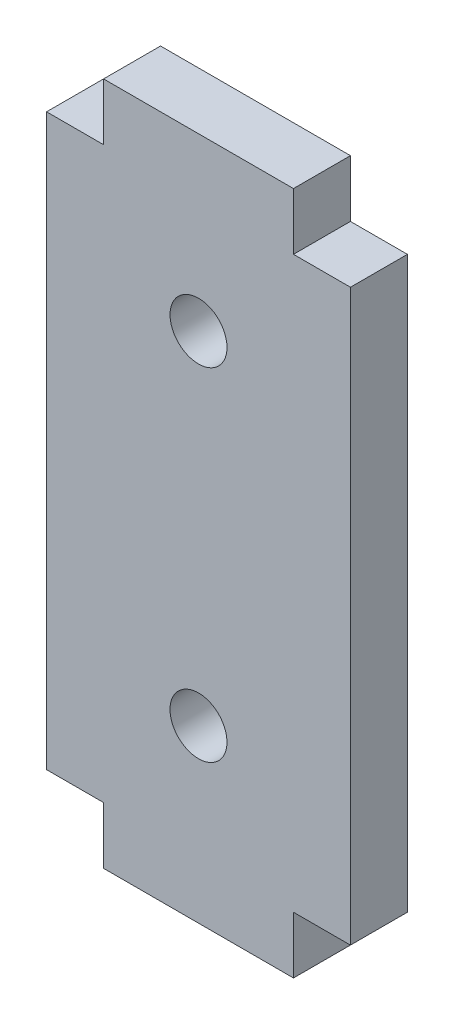
ISO-10303-21;
HEADER;
FILE_DESCRIPTION(('STEP AP214'),'2;1');
FILE_NAME('part.step','',(''),(''),'','','');
FILE_SCHEMA(('AUTOMOTIVE_DESIGN { 1 0 10303 214 1 1 1 1 }'));
ENDSEC;
DATA;
#1=APPLICATION_CONTEXT('core data for automotive mechanical design processes');
#2=APPLICATION_PROTOCOL_DEFINITION('international standard','automotive_design',2000,#1);
#3=PRODUCT_CONTEXT('',#1,'mechanical');
#4=PRODUCT('Part','Part','',(#3));
#5=PRODUCT_RELATED_PRODUCT_CATEGORY('part','',(#4));
#6=PRODUCT_DEFINITION_FORMATION('','',#4);
#7=PRODUCT_DEFINITION_CONTEXT('part definition',#1,'design');
#8=PRODUCT_DEFINITION('design','',#6,#7);
#9=PRODUCT_DEFINITION_SHAPE('','',#8);
#10=(LENGTH_UNIT() NAMED_UNIT(*) SI_UNIT(.MILLI.,.METRE.));
#11=(NAMED_UNIT(*) PLANE_ANGLE_UNIT() SI_UNIT($,.RADIAN.));
#12=(NAMED_UNIT(*) SI_UNIT($,.STERADIAN.) SOLID_ANGLE_UNIT());
#13=UNCERTAINTY_MEASURE_WITH_UNIT(LENGTH_MEASURE(1.E-05),#10,'distance_accuracy_value','');
#14=(GEOMETRIC_REPRESENTATION_CONTEXT(3) GLOBAL_UNCERTAINTY_ASSIGNED_CONTEXT((#13)) GLOBAL_UNIT_ASSIGNED_CONTEXT((#10,
#11,#12)) REPRESENTATION_CONTEXT('',''));
#15=CARTESIAN_POINT('',(0.,0.,0.));
#16=DIRECTION('',(0.,0.,1.));
#17=DIRECTION('',(1.,0.,0.));
#18=AXIS2_PLACEMENT_3D('',#15,#16,#17);
#19=CARTESIAN_POINT('',(0.,0.,3.));
#20=DIRECTION('',(0.,0.,1.));
#21=DIRECTION('',(1.,0.,0.));
#22=AXIS2_PLACEMENT_3D('',#19,#20,#21);
#23=PLANE('',#22);
#24=CARTESIAN_POINT('',(0.,9.,3.));
#25=DIRECTION('',(0.,0.,1.));
#26=DIRECTION('',(1.,0.,0.));
#27=AXIS2_PLACEMENT_3D('',#24,#25,#26);
#28=CIRCLE('',#27,1.5);
#29=CARTESIAN_POINT('',(1.5,9.,3.));
#30=VERTEX_POINT('',#29);
#31=EDGE_CURVE('E158',#30,#30,#28,.T.);
#32=ORIENTED_EDGE('',*,*,#31,.F.);
#33=EDGE_LOOP('',(#32));
#34=FACE_BOUND('',#33,.T.);
#35=DIRECTION('',(0.,-1.,0.));
#36=VECTOR('',#35,1.);
#37=CARTESIAN_POINT('',(-5.,18.,3.));
#38=LINE('',#37,#36);
#39=CARTESIAN_POINT('',(-5.,18.,3.));
#40=VERTEX_POINT('',#39);
#41=CARTESIAN_POINT('',(-5.,15.,3.));
#42=VERTEX_POINT('',#41);
#43=EDGE_CURVE('E177',#40,#42,#38,.T.);
#44=ORIENTED_EDGE('',*,*,#43,.T.);
#45=DIRECTION('',(-1.,0.,0.));
#46=VECTOR('',#45,1.);
#47=CARTESIAN_POINT('',(-8.,15.,3.));
#48=LINE('',#47,#46);
#49=CARTESIAN_POINT('',(-8.,15.,3.));
#50=VERTEX_POINT('',#49);
#51=EDGE_CURVE('E105',#42,#50,#48,.T.);
#52=ORIENTED_EDGE('',*,*,#51,.T.);
#53=DIRECTION('',(0.,-1.,0.));
#54=VECTOR('',#53,1.);
#55=CARTESIAN_POINT('',(-8.,15.,3.));
#56=LINE('',#55,#54);
#57=CARTESIAN_POINT('',(-8.,-15.,3.));
#58=VERTEX_POINT('',#57);
#59=EDGE_CURVE('E204',#50,#58,#56,.T.);
#60=ORIENTED_EDGE('',*,*,#59,.T.);
#61=DIRECTION('',(1.,0.,0.));
#62=VECTOR('',#61,1.);
#63=CARTESIAN_POINT('',(-8.,-15.,3.));
#64=LINE('',#63,#62);
#65=CARTESIAN_POINT('',(-5.,-15.,3.));
#66=VERTEX_POINT('',#65);
#67=EDGE_CURVE('E223',#58,#66,#64,.T.);
#68=ORIENTED_EDGE('',*,*,#67,.T.);
#69=DIRECTION('',(0.,-1.,0.));
#70=VECTOR('',#69,1.);
#71=CARTESIAN_POINT('',(-5.,-18.,3.));
#72=LINE('',#71,#70);
#73=CARTESIAN_POINT('',(-5.,-18.,3.));
#74=VERTEX_POINT('',#73);
#75=EDGE_CURVE('E220',#66,#74,#72,.T.);
#76=ORIENTED_EDGE('',*,*,#75,.T.);
#77=DIRECTION('',(1.,0.,0.));
#78=VECTOR('',#77,1.);
#79=CARTESIAN_POINT('',(-5.,-18.,3.));
#80=LINE('',#79,#78);
#81=CARTESIAN_POINT('',(4.99999999999999,-18.,3.));
#82=VERTEX_POINT('',#81);
#83=EDGE_CURVE('E222',#74,#82,#80,.T.);
#84=ORIENTED_EDGE('',*,*,#83,.T.);
#85=DIRECTION('',(0.,1.,0.));
#86=VECTOR('',#85,1.);
#87=CARTESIAN_POINT('',(4.99999999999999,-18.,3.));
#88=LINE('',#87,#86);
#89=CARTESIAN_POINT('',(4.99999999999999,-15.,3.));
#90=VERTEX_POINT('',#89);
#91=EDGE_CURVE('E225',#82,#90,#88,.T.);
#92=ORIENTED_EDGE('',*,*,#91,.T.);
#93=DIRECTION('',(1.,0.,0.));
#94=VECTOR('',#93,1.);
#95=CARTESIAN_POINT('',(4.99999999999999,-15.,3.));
#96=LINE('',#95,#94);
#97=CARTESIAN_POINT('',(8.,-15.,3.));
#98=VERTEX_POINT('',#97);
#99=EDGE_CURVE('E231',#90,#98,#96,.T.);
#100=ORIENTED_EDGE('',*,*,#99,.T.);
#101=DIRECTION('',(0.,1.,0.));
#102=VECTOR('',#101,1.);
#103=CARTESIAN_POINT('',(8.,15.,3.));
#104=LINE('',#103,#102);
#105=CARTESIAN_POINT('',(8.,15.,3.));
#106=VERTEX_POINT('',#105);
#107=EDGE_CURVE('E136',#98,#106,#104,.T.);
#108=ORIENTED_EDGE('',*,*,#107,.T.);
#109=DIRECTION('',(-1.,0.,0.));
#110=VECTOR('',#109,1.);
#111=CARTESIAN_POINT('',(5.,15.,3.));
#112=LINE('',#111,#110);
#113=CARTESIAN_POINT('',(5.,15.,3.));
#114=VERTEX_POINT('',#113);
#115=EDGE_CURVE('E130',#106,#114,#112,.T.);
#116=ORIENTED_EDGE('',*,*,#115,.T.);
#117=DIRECTION('',(0.,1.,0.));
#118=VECTOR('',#117,1.);
#119=CARTESIAN_POINT('',(5.,18.,3.));
#120=LINE('',#119,#118);
#121=CARTESIAN_POINT('',(5.,18.,3.));
#122=VERTEX_POINT('',#121);
#123=EDGE_CURVE('E134',#114,#122,#120,.T.);
#124=ORIENTED_EDGE('',*,*,#123,.T.);
#125=DIRECTION('',(-1.,0.,0.));
#126=VECTOR('',#125,1.);
#127=CARTESIAN_POINT('',(-5.,18.,3.));
#128=LINE('',#127,#126);
#129=EDGE_CURVE('E50',#122,#40,#128,.T.);
#130=ORIENTED_EDGE('',*,*,#129,.T.);
#131=EDGE_LOOP('',(#44,#52,#60,#68,#76,#84,#92,#100,#108,#116,#124,#130));
#132=FACE_BOUND('',#131,.T.);
#133=CARTESIAN_POINT('',(0.,-9.,3.));
#134=DIRECTION('',(0.,0.,1.));
#135=DIRECTION('',(-1.,0.,0.));
#136=AXIS2_PLACEMENT_3D('',#133,#134,#135);
#137=CIRCLE('',#136,1.5);
#138=CARTESIAN_POINT('',(-1.50000000000001,-9.,3.));
#139=VERTEX_POINT('',#138);
#140=EDGE_CURVE('E273',#139,#139,#137,.T.);
#141=ORIENTED_EDGE('',*,*,#140,.F.);
#142=EDGE_LOOP('',(#141));
#143=FACE_BOUND('',#142,.T.);
#144=ADVANCED_FACE('F33',(#34,#132,#143),#23,.T.);
#145=CARTESIAN_POINT('',(0.,0.,0.));
#146=DIRECTION('',(0.,0.,1.));
#147=DIRECTION('',(1.,0.,0.));
#148=AXIS2_PLACEMENT_3D('',#145,#146,#147);
#149=PLANE('',#148);
#150=DIRECTION('',(0.,-1.,0.));
#151=VECTOR('',#150,1.);
#152=CARTESIAN_POINT('',(-5.,18.,0.));
#153=LINE('',#152,#151);
#154=CARTESIAN_POINT('',(-5.,18.,0.));
#155=VERTEX_POINT('',#154);
#156=CARTESIAN_POINT('',(-5.,15.,0.));
#157=VERTEX_POINT('',#156);
#158=EDGE_CURVE('E154',#155,#157,#153,.T.);
#159=ORIENTED_EDGE('',*,*,#158,.F.);
#160=DIRECTION('',(-1.,0.,0.));
#161=VECTOR('',#160,1.);
#162=CARTESIAN_POINT('',(-5.,18.,0.));
#163=LINE('',#162,#161);
#164=CARTESIAN_POINT('',(5.,18.,0.));
#165=VERTEX_POINT('',#164);
#166=EDGE_CURVE('E97',#165,#155,#163,.T.);
#167=ORIENTED_EDGE('',*,*,#166,.F.);
#168=DIRECTION('',(0.,1.,0.));
#169=VECTOR('',#168,1.);
#170=CARTESIAN_POINT('',(5.,18.,0.));
#171=LINE('',#170,#169);
#172=CARTESIAN_POINT('',(5.,15.,0.));
#173=VERTEX_POINT('',#172);
#174=EDGE_CURVE('E91',#173,#165,#171,.T.);
#175=ORIENTED_EDGE('',*,*,#174,.F.);
#176=DIRECTION('',(-1.,0.,0.));
#177=VECTOR('',#176,1.);
#178=CARTESIAN_POINT('',(5.,15.,0.));
#179=LINE('',#178,#177);
#180=CARTESIAN_POINT('',(8.,15.,0.));
#181=VERTEX_POINT('',#180);
#182=EDGE_CURVE('E144',#181,#173,#179,.T.);
#183=ORIENTED_EDGE('',*,*,#182,.F.);
#184=DIRECTION('',(0.,1.,0.));
#185=VECTOR('',#184,1.);
#186=CARTESIAN_POINT('',(8.,15.,0.));
#187=LINE('',#186,#185);
#188=CARTESIAN_POINT('',(8.,-15.,0.));
#189=VERTEX_POINT('',#188);
#190=EDGE_CURVE('E172',#189,#181,#187,.T.);
#191=ORIENTED_EDGE('',*,*,#190,.F.);
#192=DIRECTION('',(1.,0.,0.));
#193=VECTOR('',#192,1.);
#194=CARTESIAN_POINT('',(4.99999999999999,-15.,0.));
#195=LINE('',#194,#193);
#196=CARTESIAN_POINT('',(4.99999999999999,-15.,0.));
#197=VERTEX_POINT('',#196);
#198=EDGE_CURVE('E170',#197,#189,#195,.T.);
#199=ORIENTED_EDGE('',*,*,#198,.F.);
#200=DIRECTION('',(0.,1.,0.));
#201=VECTOR('',#200,1.);
#202=CARTESIAN_POINT('',(4.99999999999999,-18.,0.));
#203=LINE('',#202,#201);
#204=CARTESIAN_POINT('',(4.99999999999999,-18.,0.));
#205=VERTEX_POINT('',#204);
#206=EDGE_CURVE('E168',#205,#197,#203,.T.);
#207=ORIENTED_EDGE('',*,*,#206,.F.);
#208=DIRECTION('',(1.,0.,0.));
#209=VECTOR('',#208,1.);
#210=CARTESIAN_POINT('',(-5.,-18.,0.));
#211=LINE('',#210,#209);
#212=CARTESIAN_POINT('',(-5.,-18.,0.));
#213=VERTEX_POINT('',#212);
#214=EDGE_CURVE('E166',#213,#205,#211,.T.);
#215=ORIENTED_EDGE('',*,*,#214,.F.);
#216=DIRECTION('',(0.,-1.,0.));
#217=VECTOR('',#216,1.);
#218=CARTESIAN_POINT('',(-5.,-18.,0.));
#219=LINE('',#218,#217);
#220=CARTESIAN_POINT('',(-5.,-15.,0.));
#221=VERTEX_POINT('',#220);
#222=EDGE_CURVE('E164',#221,#213,#219,.T.);
#223=ORIENTED_EDGE('',*,*,#222,.F.);
#224=DIRECTION('',(1.,0.,0.));
#225=VECTOR('',#224,1.);
#226=CARTESIAN_POINT('',(-8.,-15.,0.));
#227=LINE('',#226,#225);
#228=CARTESIAN_POINT('',(-8.,-15.,0.));
#229=VERTEX_POINT('',#228);
#230=EDGE_CURVE('E162',#229,#221,#227,.T.);
#231=ORIENTED_EDGE('',*,*,#230,.F.);
#232=DIRECTION('',(0.,-1.,0.));
#233=VECTOR('',#232,1.);
#234=CARTESIAN_POINT('',(-8.,15.,0.));
#235=LINE('',#234,#233);
#236=CARTESIAN_POINT('',(-8.,15.,0.));
#237=VERTEX_POINT('',#236);
#238=EDGE_CURVE('E160',#237,#229,#235,.T.);
#239=ORIENTED_EDGE('',*,*,#238,.F.);
#240=DIRECTION('',(-1.,0.,0.));
#241=VECTOR('',#240,1.);
#242=CARTESIAN_POINT('',(-8.,15.,0.));
#243=LINE('',#242,#241);
#244=EDGE_CURVE('E157',#157,#237,#243,.T.);
#245=ORIENTED_EDGE('',*,*,#244,.F.);
#246=EDGE_LOOP('',(#159,#167,#175,#183,#191,#199,#207,#215,#223,#231,#239,#245));
#247=FACE_BOUND('',#246,.T.);
#248=CARTESIAN_POINT('',(0.,9.,0.));
#249=DIRECTION('',(0.,0.,1.));
#250=DIRECTION('',(1.,0.,0.));
#251=AXIS2_PLACEMENT_3D('',#248,#249,#250);
#252=CIRCLE('',#251,1.5);
#253=CARTESIAN_POINT('',(1.5,9.,0.));
#254=VERTEX_POINT('',#253);
#255=EDGE_CURVE('E279',#254,#254,#252,.T.);
#256=ORIENTED_EDGE('',*,*,#255,.T.);
#257=EDGE_LOOP('',(#256));
#258=FACE_BOUND('',#257,.T.);
#259=CARTESIAN_POINT('',(0.,-9.,0.));
#260=DIRECTION('',(0.,0.,1.));
#261=DIRECTION('',(-1.,0.,0.));
#262=AXIS2_PLACEMENT_3D('',#259,#260,#261);
#263=CIRCLE('',#262,1.5);
#264=CARTESIAN_POINT('',(-1.50000000000001,-9.,0.));
#265=VERTEX_POINT('',#264);
#266=EDGE_CURVE('E276',#265,#265,#263,.T.);
#267=ORIENTED_EDGE('',*,*,#266,.T.);
#268=EDGE_LOOP('',(#267));
#269=FACE_BOUND('',#268,.T.);
#270=ADVANCED_FACE('F208',(#247,#258,#269),#149,.F.);
#271=CARTESIAN_POINT('',(-5.,18.,3.));
#272=DIRECTION('',(1.,0.,0.));
#273=DIRECTION('',(0.,0.,-1.));
#274=AXIS2_PLACEMENT_3D('',#271,#272,#273);
#275=PLANE('',#274);
#276=ORIENTED_EDGE('',*,*,#158,.T.);
#277=DIRECTION('',(0.,0.,-1.));
#278=VECTOR('',#277,1.);
#279=CARTESIAN_POINT('',(-5.,15.,3.));
#280=LINE('',#279,#278);
#281=EDGE_CURVE('E11',#42,#157,#280,.T.);
#282=ORIENTED_EDGE('',*,*,#281,.F.);
#283=ORIENTED_EDGE('',*,*,#43,.F.);
#284=DIRECTION('',(0.,0.,-1.));
#285=VECTOR('',#284,1.);
#286=CARTESIAN_POINT('',(-5.,18.,3.));
#287=LINE('',#286,#285);
#288=EDGE_CURVE('E150',#40,#155,#287,.T.);
#289=ORIENTED_EDGE('',*,*,#288,.T.);
#290=EDGE_LOOP('',(#276,#282,#283,#289));
#291=FACE_BOUND('',#290,.T.);
#292=ADVANCED_FACE('F35',(#291),#275,.F.);
#293=CARTESIAN_POINT('',(-8.,15.,3.));
#294=DIRECTION('',(0.,-1.,0.));
#295=DIRECTION('',(0.,0.,-1.));
#296=AXIS2_PLACEMENT_3D('',#293,#294,#295);
#297=PLANE('',#296);
#298=ORIENTED_EDGE('',*,*,#244,.T.);
#299=DIRECTION('',(0.,0.,-1.));
#300=VECTOR('',#299,1.);
#301=CARTESIAN_POINT('',(-8.,15.,3.));
#302=LINE('',#301,#300);
#303=EDGE_CURVE('E42',#50,#237,#302,.T.);
#304=ORIENTED_EDGE('',*,*,#303,.F.);
#305=ORIENTED_EDGE('',*,*,#51,.F.);
#306=ORIENTED_EDGE('',*,*,#281,.T.);
#307=EDGE_LOOP('',(#298,#304,#305,#306));
#308=FACE_BOUND('',#307,.T.);
#309=ADVANCED_FACE('F372',(#308),#297,.F.);
#310=CARTESIAN_POINT('',(-8.,15.,3.));
#311=DIRECTION('',(1.,0.,0.));
#312=DIRECTION('',(0.,0.,-1.));
#313=AXIS2_PLACEMENT_3D('',#310,#311,#312);
#314=PLANE('',#313);
#315=ORIENTED_EDGE('',*,*,#238,.T.);
#316=DIRECTION('',(0.,0.,-1.));
#317=VECTOR('',#316,1.);
#318=CARTESIAN_POINT('',(-8.,-15.,3.));
#319=LINE('',#318,#317);
#320=EDGE_CURVE('E196',#58,#229,#319,.T.);
#321=ORIENTED_EDGE('',*,*,#320,.F.);
#322=ORIENTED_EDGE('',*,*,#59,.F.);
#323=ORIENTED_EDGE('',*,*,#303,.T.);
#324=EDGE_LOOP('',(#315,#321,#322,#323));
#325=FACE_BOUND('',#324,.T.);
#326=ADVANCED_FACE('F202',(#325),#314,.F.);
#327=CARTESIAN_POINT('',(-8.,-15.,3.));
#328=DIRECTION('',(0.,1.,0.));
#329=DIRECTION('',(0.,0.,1.));
#330=AXIS2_PLACEMENT_3D('',#327,#328,#329);
#331=PLANE('',#330);
#332=ORIENTED_EDGE('',*,*,#230,.T.);
#333=DIRECTION('',(0.,0.,-1.));
#334=VECTOR('',#333,1.);
#335=CARTESIAN_POINT('',(-5.,-15.,3.));
#336=LINE('',#335,#334);
#337=EDGE_CURVE('E193',#66,#221,#336,.T.);
#338=ORIENTED_EDGE('',*,*,#337,.F.);
#339=ORIENTED_EDGE('',*,*,#67,.F.);
#340=ORIENTED_EDGE('',*,*,#320,.T.);
#341=EDGE_LOOP('',(#332,#338,#339,#340));
#342=FACE_BOUND('',#341,.T.);
#343=ADVANCED_FACE('F214',(#342),#331,.F.);
#344=CARTESIAN_POINT('',(-5.,-18.,3.));
#345=DIRECTION('',(1.,0.,0.));
#346=DIRECTION('',(0.,0.,-1.));
#347=AXIS2_PLACEMENT_3D('',#344,#345,#346);
#348=PLANE('',#347);
#349=ORIENTED_EDGE('',*,*,#222,.T.);
#350=DIRECTION('',(0.,0.,-1.));
#351=VECTOR('',#350,1.);
#352=CARTESIAN_POINT('',(-5.,-18.,3.));
#353=LINE('',#352,#351);
#354=EDGE_CURVE('E190',#74,#213,#353,.T.);
#355=ORIENTED_EDGE('',*,*,#354,.F.);
#356=ORIENTED_EDGE('',*,*,#75,.F.);
#357=ORIENTED_EDGE('',*,*,#337,.T.);
#358=EDGE_LOOP('',(#349,#355,#356,#357));
#359=FACE_BOUND('',#358,.T.);
#360=ADVANCED_FACE('F218',(#359),#348,.F.);
#361=CARTESIAN_POINT('',(-5.,-18.,3.));
#362=DIRECTION('',(0.,1.,0.));
#363=DIRECTION('',(0.,0.,1.));
#364=AXIS2_PLACEMENT_3D('',#361,#362,#363);
#365=PLANE('',#364);
#366=ORIENTED_EDGE('',*,*,#214,.T.);
#367=DIRECTION('',(0.,0.,-1.));
#368=VECTOR('',#367,1.);
#369=CARTESIAN_POINT('',(4.99999999999999,-18.,3.));
#370=LINE('',#369,#368);
#371=EDGE_CURVE('E187',#82,#205,#370,.T.);
#372=ORIENTED_EDGE('',*,*,#371,.F.);
#373=ORIENTED_EDGE('',*,*,#83,.F.);
#374=ORIENTED_EDGE('',*,*,#354,.T.);
#375=EDGE_LOOP('',(#366,#372,#373,#374));
#376=FACE_BOUND('',#375,.T.);
#377=ADVANCED_FACE('F337',(#376),#365,.F.);
#378=CARTESIAN_POINT('',(4.99999999999999,-18.,3.));
#379=DIRECTION('',(-1.,0.,0.));
#380=DIRECTION('',(0.,-1.,0.));
#381=AXIS2_PLACEMENT_3D('',#378,#379,#380);
#382=PLANE('',#381);
#383=ORIENTED_EDGE('',*,*,#206,.T.);
#384=DIRECTION('',(0.,0.,-1.));
#385=VECTOR('',#384,1.);
#386=CARTESIAN_POINT('',(4.99999999999999,-15.,3.));
#387=LINE('',#386,#385);
#388=EDGE_CURVE('E184',#90,#197,#387,.T.);
#389=ORIENTED_EDGE('',*,*,#388,.F.);
#390=ORIENTED_EDGE('',*,*,#91,.F.);
#391=ORIENTED_EDGE('',*,*,#371,.T.);
#392=EDGE_LOOP('',(#383,#389,#390,#391));
#393=FACE_BOUND('',#392,.T.);
#394=ADVANCED_FACE('F328',(#393),#382,.F.);
#395=CARTESIAN_POINT('',(4.99999999999999,-15.,3.));
#396=DIRECTION('',(0.,1.,0.));
#397=DIRECTION('',(0.,0.,1.));
#398=AXIS2_PLACEMENT_3D('',#395,#396,#397);
#399=PLANE('',#398);
#400=ORIENTED_EDGE('',*,*,#198,.T.);
#401=DIRECTION('',(0.,0.,-1.));
#402=VECTOR('',#401,1.);
#403=CARTESIAN_POINT('',(8.,-15.,3.));
#404=LINE('',#403,#402);
#405=EDGE_CURVE('E181',#98,#189,#404,.T.);
#406=ORIENTED_EDGE('',*,*,#405,.F.);
#407=ORIENTED_EDGE('',*,*,#99,.F.);
#408=ORIENTED_EDGE('',*,*,#388,.T.);
#409=EDGE_LOOP('',(#400,#406,#407,#408));
#410=FACE_BOUND('',#409,.T.);
#411=ADVANCED_FACE('F237',(#410),#399,.F.);
#412=CARTESIAN_POINT('',(8.,15.,3.));
#413=DIRECTION('',(-1.,0.,0.));
#414=DIRECTION('',(0.,0.,1.));
#415=AXIS2_PLACEMENT_3D('',#412,#413,#414);
#416=PLANE('',#415);
#417=ORIENTED_EDGE('',*,*,#190,.T.);
#418=DIRECTION('',(0.,0.,-1.));
#419=VECTOR('',#418,1.);
#420=CARTESIAN_POINT('',(8.,15.,3.));
#421=LINE('',#420,#419);
#422=EDGE_CURVE('E145',#106,#181,#421,.T.);
#423=ORIENTED_EDGE('',*,*,#422,.F.);
#424=ORIENTED_EDGE('',*,*,#107,.F.);
#425=ORIENTED_EDGE('',*,*,#405,.T.);
#426=EDGE_LOOP('',(#417,#423,#424,#425));
#427=FACE_BOUND('',#426,.T.);
#428=ADVANCED_FACE('F241',(#427),#416,.F.);
#429=CARTESIAN_POINT('',(5.,15.,3.));
#430=DIRECTION('',(0.,-1.,0.));
#431=DIRECTION('',(0.,0.,-1.));
#432=AXIS2_PLACEMENT_3D('',#429,#430,#431);
#433=PLANE('',#432);
#434=ORIENTED_EDGE('',*,*,#182,.T.);
#435=DIRECTION('',(0.,0.,-1.));
#436=VECTOR('',#435,1.);
#437=CARTESIAN_POINT('',(5.,15.,3.));
#438=LINE('',#437,#436);
#439=EDGE_CURVE('E141',#114,#173,#438,.T.);
#440=ORIENTED_EDGE('',*,*,#439,.F.);
#441=ORIENTED_EDGE('',*,*,#115,.F.);
#442=ORIENTED_EDGE('',*,*,#422,.T.);
#443=EDGE_LOOP('',(#434,#440,#441,#442));
#444=FACE_BOUND('',#443,.T.);
#445=ADVANCED_FACE('F142',(#444),#433,.F.);
#446=CARTESIAN_POINT('',(5.,18.,3.));
#447=DIRECTION('',(-1.,0.,0.));
#448=DIRECTION('',(0.,-1.,0.));
#449=AXIS2_PLACEMENT_3D('',#446,#447,#448);
#450=PLANE('',#449);
#451=ORIENTED_EDGE('',*,*,#174,.T.);
#452=DIRECTION('',(0.,0.,-1.));
#453=VECTOR('',#452,1.);
#454=CARTESIAN_POINT('',(5.,18.,3.));
#455=LINE('',#454,#453);
#456=EDGE_CURVE('E146',#122,#165,#455,.T.);
#457=ORIENTED_EDGE('',*,*,#456,.F.);
#458=ORIENTED_EDGE('',*,*,#123,.F.);
#459=ORIENTED_EDGE('',*,*,#439,.T.);
#460=EDGE_LOOP('',(#451,#457,#458,#459));
#461=FACE_BOUND('',#460,.T.);
#462=ADVANCED_FACE('F148',(#461),#450,.F.);
#463=CARTESIAN_POINT('',(-5.,18.,3.));
#464=DIRECTION('',(0.,-1.,0.));
#465=DIRECTION('',(0.,0.,-1.));
#466=AXIS2_PLACEMENT_3D('',#463,#464,#465);
#467=PLANE('',#466);
#468=ORIENTED_EDGE('',*,*,#166,.T.);
#469=ORIENTED_EDGE('',*,*,#288,.F.);
#470=ORIENTED_EDGE('',*,*,#129,.F.);
#471=ORIENTED_EDGE('',*,*,#456,.T.);
#472=EDGE_LOOP('',(#468,#469,#470,#471));
#473=FACE_BOUND('',#472,.T.);
#474=ADVANCED_FACE('F245',(#473),#467,.F.);
#475=CARTESIAN_POINT('',(0.,9.,3.));
#476=DIRECTION('',(0.,0.,-1.));
#477=DIRECTION('',(-1.,0.,0.));
#478=AXIS2_PLACEMENT_3D('',#475,#476,#477);
#479=CYLINDRICAL_SURFACE('',#478,1.5);
#480=ORIENTED_EDGE('',*,*,#31,.T.);
#481=EDGE_LOOP('',(#480));
#482=FACE_BOUND('',#481,.T.);
#483=ORIENTED_EDGE('',*,*,#255,.F.);
#484=EDGE_LOOP('',(#483));
#485=FACE_BOUND('',#484,.T.);
#486=ADVANCED_FACE('F247',(#482,#485),#479,.F.);
#487=CARTESIAN_POINT('',(0.,-9.,3.));
#488=DIRECTION('',(0.,0.,-1.));
#489=DIRECTION('',(-1.,0.,0.));
#490=AXIS2_PLACEMENT_3D('',#487,#488,#489);
#491=CYLINDRICAL_SURFACE('',#490,1.5);
#492=ORIENTED_EDGE('',*,*,#140,.T.);
#493=EDGE_LOOP('',(#492));
#494=FACE_BOUND('',#493,.T.);
#495=ORIENTED_EDGE('',*,*,#266,.F.);
#496=EDGE_LOOP('',(#495));
#497=FACE_BOUND('',#496,.T.);
#498=ADVANCED_FACE('F253',(#494,#497),#491,.F.);
#499=CLOSED_SHELL('',(#144,#270,#292,#309,#326,#343,#360,#377,#394,#411,#428,#445,#462,#474,
#486,#498));
#500=MANIFOLD_SOLID_BREP('B2',#499);
#501=ADVANCED_BREP_SHAPE_REPRESENTATION('',(#18,#500),#14);
#502=SHAPE_DEFINITION_REPRESENTATION(#9,#501);
ENDSEC;
END-ISO-10303-21;
